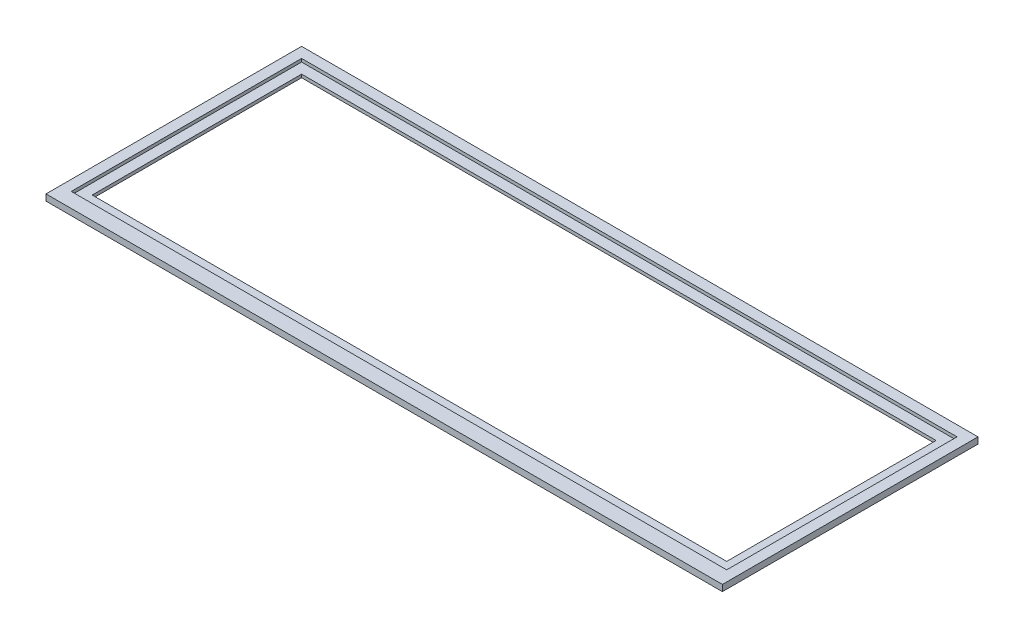
ISO-10303-21;
HEADER;
FILE_DESCRIPTION(('STEP AP214'),'2;1');
FILE_NAME('part.step','',(''),(''),'','','');
FILE_SCHEMA(('AUTOMOTIVE_DESIGN { 1 0 10303 214 1 1 1 1 }'));
ENDSEC;
DATA;
#1=APPLICATION_CONTEXT('core data for automotive mechanical design processes');
#2=APPLICATION_PROTOCOL_DEFINITION('international standard','automotive_design',2000,#1);
#3=PRODUCT_CONTEXT('',#1,'mechanical');
#4=PRODUCT('Part','Part','',(#3));
#5=PRODUCT_RELATED_PRODUCT_CATEGORY('part','',(#4));
#6=PRODUCT_DEFINITION_FORMATION('','',#4);
#7=PRODUCT_DEFINITION_CONTEXT('part definition',#1,'design');
#8=PRODUCT_DEFINITION('design','',#6,#7);
#9=PRODUCT_DEFINITION_SHAPE('','',#8);
#10=(LENGTH_UNIT() NAMED_UNIT(*) SI_UNIT(.MILLI.,.METRE.));
#11=(NAMED_UNIT(*) PLANE_ANGLE_UNIT() SI_UNIT($,.RADIAN.));
#12=(NAMED_UNIT(*) SI_UNIT($,.STERADIAN.) SOLID_ANGLE_UNIT());
#13=UNCERTAINTY_MEASURE_WITH_UNIT(LENGTH_MEASURE(1.E-05),#10,'distance_accuracy_value','');
#14=(GEOMETRIC_REPRESENTATION_CONTEXT(3) GLOBAL_UNCERTAINTY_ASSIGNED_CONTEXT((#13)) GLOBAL_UNIT_ASSIGNED_CONTEXT((#10,
#11,#12)) REPRESENTATION_CONTEXT('',''));
#15=CARTESIAN_POINT('',(0.,0.,0.));
#16=DIRECTION('',(0.,0.,1.));
#17=DIRECTION('',(1.,0.,0.));
#18=AXIS2_PLACEMENT_3D('',#15,#16,#17);
#19=CARTESIAN_POINT('',(161.5,3.,-60.));
#20=DIRECTION('',(-1.,0.,0.));
#21=DIRECTION('',(0.,0.,1.));
#22=AXIS2_PLACEMENT_3D('',#19,#20,#21);
#23=PLANE('',#22);
#24=DIRECTION('',(0.,0.,-1.));
#25=VECTOR('',#24,1.);
#26=CARTESIAN_POINT('',(161.5,0.,-60.));
#27=LINE('',#26,#25);
#28=CARTESIAN_POINT('',(161.5,0.,62.051483501009));
#29=VERTEX_POINT('',#28);
#30=CARTESIAN_POINT('',(161.5,0.,-60.));
#31=VERTEX_POINT('',#30);
#32=EDGE_CURVE('E147',#29,#31,#27,.T.);
#33=ORIENTED_EDGE('',*,*,#32,.T.);
#34=DIRECTION('',(0.,-1.,0.));
#35=VECTOR('',#34,1.);
#36=CARTESIAN_POINT('',(161.5,3.,-60.));
#37=LINE('',#36,#35);
#38=CARTESIAN_POINT('',(161.5,3.,-60.));
#39=VERTEX_POINT('',#38);
#40=EDGE_CURVE('E11',#39,#31,#37,.T.);
#41=ORIENTED_EDGE('',*,*,#40,.F.);
#42=DIRECTION('',(0.,0.,-1.));
#43=VECTOR('',#42,1.);
#44=CARTESIAN_POINT('',(161.5,3.,-60.));
#45=LINE('',#44,#43);
#46=CARTESIAN_POINT('',(161.5,3.,62.051483501009));
#47=VERTEX_POINT('',#46);
#48=EDGE_CURVE('E140',#47,#39,#45,.T.);
#49=ORIENTED_EDGE('',*,*,#48,.F.);
#50=DIRECTION('',(0.,1.,0.));
#51=VECTOR('',#50,1.);
#52=CARTESIAN_POINT('',(161.5,0.,62.051483501009));
#53=LINE('',#52,#51);
#54=EDGE_CURVE('E155',#29,#47,#53,.T.);
#55=ORIENTED_EDGE('',*,*,#54,.F.);
#56=EDGE_LOOP('',(#33,#41,#49,#55));
#57=FACE_BOUND('',#56,.T.);
#58=ADVANCED_FACE('F41',(#57),#23,.F.);
#59=CARTESIAN_POINT('',(-161.5,3.,-60.));
#60=DIRECTION('',(0.,0.,1.));
#61=DIRECTION('',(1.,0.,0.));
#62=AXIS2_PLACEMENT_3D('',#59,#60,#61);
#63=PLANE('',#62);
#64=DIRECTION('',(-1.,0.,0.));
#65=VECTOR('',#64,1.);
#66=CARTESIAN_POINT('',(-161.5,0.,-60.));
#67=LINE('',#66,#65);
#68=CARTESIAN_POINT('',(-161.5,0.,-60.));
#69=VERTEX_POINT('',#68);
#70=EDGE_CURVE('E141',#31,#69,#67,.T.);
#71=ORIENTED_EDGE('',*,*,#70,.T.);
#72=DIRECTION('',(0.,-1.,0.));
#73=VECTOR('',#72,1.);
#74=CARTESIAN_POINT('',(-161.5,3.,-60.));
#75=LINE('',#74,#73);
#76=CARTESIAN_POINT('',(-161.5,3.,-60.));
#77=VERTEX_POINT('',#76);
#78=EDGE_CURVE('E48',#77,#69,#75,.T.);
#79=ORIENTED_EDGE('',*,*,#78,.F.);
#80=DIRECTION('',(-1.,0.,0.));
#81=VECTOR('',#80,1.);
#82=CARTESIAN_POINT('',(-161.5,3.,-60.));
#83=LINE('',#82,#81);
#84=EDGE_CURVE('E221',#39,#77,#83,.T.);
#85=ORIENTED_EDGE('',*,*,#84,.F.);
#86=ORIENTED_EDGE('',*,*,#40,.T.);
#87=EDGE_LOOP('',(#71,#79,#85,#86));
#88=FACE_BOUND('',#87,.T.);
#89=ADVANCED_FACE('F227',(#88),#63,.F.);
#90=CARTESIAN_POINT('',(-161.5,3.,-60.));
#91=DIRECTION('',(1.,0.,0.));
#92=DIRECTION('',(0.,0.,-1.));
#93=AXIS2_PLACEMENT_3D('',#90,#91,#92);
#94=PLANE('',#93);
#95=DIRECTION('',(0.,0.,1.));
#96=VECTOR('',#95,1.);
#97=CARTESIAN_POINT('',(-161.5,0.,-60.));
#98=LINE('',#97,#96);
#99=CARTESIAN_POINT('',(-161.5,0.,62.051483501009));
#100=VERTEX_POINT('',#99);
#101=EDGE_CURVE('E131',#69,#100,#98,.T.);
#102=ORIENTED_EDGE('',*,*,#101,.T.);
#103=DIRECTION('',(0.,1.,0.));
#104=VECTOR('',#103,1.);
#105=CARTESIAN_POINT('',(-161.5,0.,62.051483501009));
#106=LINE('',#105,#104);
#107=CARTESIAN_POINT('',(-161.5,3.,62.051483501009));
#108=VERTEX_POINT('',#107);
#109=EDGE_CURVE('E136',#100,#108,#106,.T.);
#110=ORIENTED_EDGE('',*,*,#109,.T.);
#111=DIRECTION('',(0.,0.,1.));
#112=VECTOR('',#111,1.);
#113=CARTESIAN_POINT('',(-161.5,3.,-60.));
#114=LINE('',#113,#112);
#115=EDGE_CURVE('E223',#77,#108,#114,.T.);
#116=ORIENTED_EDGE('',*,*,#115,.F.);
#117=ORIENTED_EDGE('',*,*,#78,.T.);
#118=EDGE_LOOP('',(#102,#110,#116,#117));
#119=FACE_BOUND('',#118,.T.);
#120=ADVANCED_FACE('F133',(#119),#94,.F.);
#121=CARTESIAN_POINT('',(0.,3.,0.));
#122=DIRECTION('',(0.,1.,0.));
#123=DIRECTION('',(0.,0.,1.));
#124=AXIS2_PLACEMENT_3D('',#121,#122,#123);
#125=PLANE('',#124);
#126=DIRECTION('',(0.,0.,1.));
#127=VECTOR('',#126,1.);
#128=CARTESIAN_POINT('',(-156.5,3.,0.));
#129=LINE('',#128,#127);
#130=CARTESIAN_POINT('',(-156.5,3.,-55.));
#131=VERTEX_POINT('',#130);
#132=CARTESIAN_POINT('',(-156.5,3.,55.));
#133=VERTEX_POINT('',#132);
#134=EDGE_CURVE('E63',#131,#133,#129,.T.);
#135=ORIENTED_EDGE('',*,*,#134,.F.);
#136=DIRECTION('',(-1.,0.,0.));
#137=VECTOR('',#136,1.);
#138=CARTESIAN_POINT('',(0.,3.,-55.));
#139=LINE('',#138,#137);
#140=CARTESIAN_POINT('',(156.5,3.,-55.));
#141=VERTEX_POINT('',#140);
#142=EDGE_CURVE('E183',#141,#131,#139,.T.);
#143=ORIENTED_EDGE('',*,*,#142,.F.);
#144=DIRECTION('',(0.,0.,-1.));
#145=VECTOR('',#144,1.);
#146=CARTESIAN_POINT('',(156.5,3.,0.));
#147=LINE('',#146,#145);
#148=CARTESIAN_POINT('',(156.5,3.,55.));
#149=VERTEX_POINT('',#148);
#150=EDGE_CURVE('E207',#149,#141,#147,.T.);
#151=ORIENTED_EDGE('',*,*,#150,.F.);
#152=DIRECTION('',(1.,0.,0.));
#153=VECTOR('',#152,1.);
#154=CARTESIAN_POINT('',(0.,3.,55.));
#155=LINE('',#154,#153);
#156=EDGE_CURVE('E204',#133,#149,#155,.T.);
#157=ORIENTED_EDGE('',*,*,#156,.F.);
#158=EDGE_LOOP('',(#135,#143,#151,#157));
#159=FACE_BOUND('',#158,.T.);
#160=ORIENTED_EDGE('',*,*,#48,.T.);
#161=ORIENTED_EDGE('',*,*,#84,.T.);
#162=ORIENTED_EDGE('',*,*,#115,.T.);
#163=DIRECTION('',(-1.,0.,0.));
#164=VECTOR('',#163,1.);
#165=CARTESIAN_POINT('',(0.,3.,62.051483501009));
#166=LINE('',#165,#164);
#167=EDGE_CURVE('E151',#47,#108,#166,.T.);
#168=ORIENTED_EDGE('',*,*,#167,.F.);
#169=EDGE_LOOP('',(#160,#161,#162,#168));
#170=FACE_BOUND('',#169,.T.);
#171=ADVANCED_FACE('F231',(#159,#170),#125,.T.);
#172=CARTESIAN_POINT('',(0.,0.,0.));
#173=DIRECTION('',(0.,1.,0.));
#174=DIRECTION('',(0.,0.,1.));
#175=AXIS2_PLACEMENT_3D('',#172,#173,#174);
#176=PLANE('',#175);
#177=DIRECTION('',(0.,0.,1.));
#178=VECTOR('',#177,1.);
#179=CARTESIAN_POINT('',(-151.5,0.,0.));
#180=LINE('',#179,#178);
#181=CARTESIAN_POINT('',(-151.5,0.,-50.));
#182=VERTEX_POINT('',#181);
#183=CARTESIAN_POINT('',(-151.5,0.,50.));
#184=VERTEX_POINT('',#183);
#185=EDGE_CURVE('E167',#182,#184,#180,.T.);
#186=ORIENTED_EDGE('',*,*,#185,.T.);
#187=DIRECTION('',(1.,0.,0.));
#188=VECTOR('',#187,1.);
#189=CARTESIAN_POINT('',(0.,0.,50.));
#190=LINE('',#189,#188);
#191=CARTESIAN_POINT('',(151.5,0.,50.));
#192=VERTEX_POINT('',#191);
#193=EDGE_CURVE('E157',#184,#192,#190,.T.);
#194=ORIENTED_EDGE('',*,*,#193,.T.);
#195=DIRECTION('',(0.,0.,-1.));
#196=VECTOR('',#195,1.);
#197=CARTESIAN_POINT('',(151.5,0.,0.));
#198=LINE('',#197,#196);
#199=CARTESIAN_POINT('',(151.5,0.,-50.));
#200=VERTEX_POINT('',#199);
#201=EDGE_CURVE('E163',#192,#200,#198,.T.);
#202=ORIENTED_EDGE('',*,*,#201,.T.);
#203=DIRECTION('',(-1.,0.,0.));
#204=VECTOR('',#203,1.);
#205=CARTESIAN_POINT('',(0.,0.,-50.));
#206=LINE('',#205,#204);
#207=EDGE_CURVE('E55',#200,#182,#206,.T.);
#208=ORIENTED_EDGE('',*,*,#207,.T.);
#209=EDGE_LOOP('',(#186,#194,#202,#208));
#210=FACE_BOUND('',#209,.T.);
#211=ORIENTED_EDGE('',*,*,#32,.F.);
#212=DIRECTION('',(-1.,0.,0.));
#213=VECTOR('',#212,1.);
#214=CARTESIAN_POINT('',(0.,0.,62.051483501009));
#215=LINE('',#214,#213);
#216=EDGE_CURVE('E144',#29,#100,#215,.T.);
#217=ORIENTED_EDGE('',*,*,#216,.T.);
#218=ORIENTED_EDGE('',*,*,#101,.F.);
#219=ORIENTED_EDGE('',*,*,#70,.F.);
#220=EDGE_LOOP('',(#211,#217,#218,#219));
#221=FACE_BOUND('',#220,.T.);
#222=ADVANCED_FACE('F145',(#210,#221),#176,.F.);
#223=CARTESIAN_POINT('',(-156.5,1.5,0.));
#224=DIRECTION('',(-1.,0.,0.));
#225=DIRECTION('',(0.,0.,1.));
#226=AXIS2_PLACEMENT_3D('',#223,#224,#225);
#227=PLANE('',#226);
#228=ORIENTED_EDGE('',*,*,#134,.T.);
#229=DIRECTION('',(0.,1.,0.));
#230=VECTOR('',#229,1.);
#231=CARTESIAN_POINT('',(-156.5,1.5,55.));
#232=LINE('',#231,#230);
#233=CARTESIAN_POINT('',(-156.5,1.5,55.));
#234=VERTEX_POINT('',#233);
#235=EDGE_CURVE('E202',#234,#133,#232,.T.);
#236=ORIENTED_EDGE('',*,*,#235,.F.);
#237=DIRECTION('',(0.,0.,1.));
#238=VECTOR('',#237,1.);
#239=CARTESIAN_POINT('',(-156.5,1.5,0.));
#240=LINE('',#239,#238);
#241=CARTESIAN_POINT('',(-156.5,1.5,-55.));
#242=VERTEX_POINT('',#241);
#243=EDGE_CURVE('E190',#242,#234,#240,.T.);
#244=ORIENTED_EDGE('',*,*,#243,.F.);
#245=DIRECTION('',(0.,1.,0.));
#246=VECTOR('',#245,1.);
#247=CARTESIAN_POINT('',(-156.5,1.5,-55.));
#248=LINE('',#247,#246);
#249=EDGE_CURVE('E212',#242,#131,#248,.T.);
#250=ORIENTED_EDGE('',*,*,#249,.T.);
#251=EDGE_LOOP('',(#228,#236,#244,#250));
#252=FACE_BOUND('',#251,.T.);
#253=ADVANCED_FACE('F239',(#252),#227,.F.);
#254=CARTESIAN_POINT('',(0.,1.5,-55.));
#255=DIRECTION('',(0.,0.,-1.));
#256=DIRECTION('',(-1.,0.,0.));
#257=AXIS2_PLACEMENT_3D('',#254,#255,#256);
#258=PLANE('',#257);
#259=ORIENTED_EDGE('',*,*,#142,.T.);
#260=ORIENTED_EDGE('',*,*,#249,.F.);
#261=DIRECTION('',(-1.,0.,0.));
#262=VECTOR('',#261,1.);
#263=CARTESIAN_POINT('',(0.,1.5,-55.));
#264=LINE('',#263,#262);
#265=CARTESIAN_POINT('',(156.5,1.5,-55.));
#266=VERTEX_POINT('',#265);
#267=EDGE_CURVE('E199',#266,#242,#264,.T.);
#268=ORIENTED_EDGE('',*,*,#267,.F.);
#269=DIRECTION('',(0.,1.,0.));
#270=VECTOR('',#269,1.);
#271=CARTESIAN_POINT('',(156.5,1.5,-55.));
#272=LINE('',#271,#270);
#273=EDGE_CURVE('E214',#266,#141,#272,.T.);
#274=ORIENTED_EDGE('',*,*,#273,.T.);
#275=EDGE_LOOP('',(#259,#260,#268,#274));
#276=FACE_BOUND('',#275,.T.);
#277=ADVANCED_FACE('F257',(#276),#258,.F.);
#278=CARTESIAN_POINT('',(156.5,1.5,0.));
#279=DIRECTION('',(1.,0.,0.));
#280=DIRECTION('',(0.,0.,-1.));
#281=AXIS2_PLACEMENT_3D('',#278,#279,#280);
#282=PLANE('',#281);
#283=ORIENTED_EDGE('',*,*,#150,.T.);
#284=ORIENTED_EDGE('',*,*,#273,.F.);
#285=DIRECTION('',(0.,0.,-1.));
#286=VECTOR('',#285,1.);
#287=CARTESIAN_POINT('',(156.5,1.5,0.));
#288=LINE('',#287,#286);
#289=CARTESIAN_POINT('',(156.5,1.5,55.));
#290=VERTEX_POINT('',#289);
#291=EDGE_CURVE('E196',#290,#266,#288,.T.);
#292=ORIENTED_EDGE('',*,*,#291,.F.);
#293=DIRECTION('',(0.,1.,0.));
#294=VECTOR('',#293,1.);
#295=CARTESIAN_POINT('',(156.5,1.5,55.));
#296=LINE('',#295,#294);
#297=EDGE_CURVE('E216',#290,#149,#296,.T.);
#298=ORIENTED_EDGE('',*,*,#297,.T.);
#299=EDGE_LOOP('',(#283,#284,#292,#298));
#300=FACE_BOUND('',#299,.T.);
#301=ADVANCED_FACE('F263',(#300),#282,.F.);
#302=CARTESIAN_POINT('',(0.,1.5,55.));
#303=DIRECTION('',(0.,0.,1.));
#304=DIRECTION('',(1.,0.,0.));
#305=AXIS2_PLACEMENT_3D('',#302,#303,#304);
#306=PLANE('',#305);
#307=ORIENTED_EDGE('',*,*,#156,.T.);
#308=ORIENTED_EDGE('',*,*,#297,.F.);
#309=DIRECTION('',(1.,0.,0.));
#310=VECTOR('',#309,1.);
#311=CARTESIAN_POINT('',(0.,1.5,55.));
#312=LINE('',#311,#310);
#313=EDGE_CURVE('E193',#234,#290,#312,.T.);
#314=ORIENTED_EDGE('',*,*,#313,.F.);
#315=ORIENTED_EDGE('',*,*,#235,.T.);
#316=EDGE_LOOP('',(#307,#308,#314,#315));
#317=FACE_BOUND('',#316,.T.);
#318=ADVANCED_FACE('F271',(#317),#306,.F.);
#319=CARTESIAN_POINT('',(0.,1.5,0.));
#320=DIRECTION('',(0.,1.,0.));
#321=DIRECTION('',(0.,0.,1.));
#322=AXIS2_PLACEMENT_3D('',#319,#320,#321);
#323=PLANE('',#322);
#324=DIRECTION('',(0.,0.,-1.));
#325=VECTOR('',#324,1.);
#326=CARTESIAN_POINT('',(151.5,1.5,0.));
#327=LINE('',#326,#325);
#328=CARTESIAN_POINT('',(151.5,1.5,50.));
#329=VERTEX_POINT('',#328);
#330=CARTESIAN_POINT('',(151.5,1.5,-50.));
#331=VERTEX_POINT('',#330);
#332=EDGE_CURVE('E180',#329,#331,#327,.T.);
#333=ORIENTED_EDGE('',*,*,#332,.F.);
#334=DIRECTION('',(1.,0.,0.));
#335=VECTOR('',#334,1.);
#336=CARTESIAN_POINT('',(0.,1.5,50.));
#337=LINE('',#336,#335);
#338=CARTESIAN_POINT('',(-151.5,1.5,50.));
#339=VERTEX_POINT('',#338);
#340=EDGE_CURVE('E182',#339,#329,#337,.T.);
#341=ORIENTED_EDGE('',*,*,#340,.F.);
#342=DIRECTION('',(0.,0.,1.));
#343=VECTOR('',#342,1.);
#344=CARTESIAN_POINT('',(-151.5,1.5,0.));
#345=LINE('',#344,#343);
#346=CARTESIAN_POINT('',(-151.5,1.5,-50.));
#347=VERTEX_POINT('',#346);
#348=EDGE_CURVE('E186',#347,#339,#345,.T.);
#349=ORIENTED_EDGE('',*,*,#348,.F.);
#350=DIRECTION('',(-1.,0.,0.));
#351=VECTOR('',#350,1.);
#352=CARTESIAN_POINT('',(0.,1.5,-50.));
#353=LINE('',#352,#351);
#354=EDGE_CURVE('E188',#331,#347,#353,.T.);
#355=ORIENTED_EDGE('',*,*,#354,.F.);
#356=EDGE_LOOP('',(#333,#341,#349,#355));
#357=FACE_BOUND('',#356,.T.);
#358=ORIENTED_EDGE('',*,*,#243,.T.);
#359=ORIENTED_EDGE('',*,*,#313,.T.);
#360=ORIENTED_EDGE('',*,*,#291,.T.);
#361=ORIENTED_EDGE('',*,*,#267,.T.);
#362=EDGE_LOOP('',(#358,#359,#360,#361));
#363=FACE_BOUND('',#362,.T.);
#364=ADVANCED_FACE('F279',(#357,#363),#323,.T.);
#365=CARTESIAN_POINT('',(0.,0.,50.));
#366=DIRECTION('',(0.,0.,1.));
#367=DIRECTION('',(1.,0.,0.));
#368=AXIS2_PLACEMENT_3D('',#365,#366,#367);
#369=PLANE('',#368);
#370=ORIENTED_EDGE('',*,*,#340,.T.);
#371=DIRECTION('',(0.,1.,0.));
#372=VECTOR('',#371,1.);
#373=CARTESIAN_POINT('',(151.5,0.,50.));
#374=LINE('',#373,#372);
#375=EDGE_CURVE('E170',#192,#329,#374,.T.);
#376=ORIENTED_EDGE('',*,*,#375,.F.);
#377=ORIENTED_EDGE('',*,*,#193,.F.);
#378=DIRECTION('',(0.,1.,0.));
#379=VECTOR('',#378,1.);
#380=CARTESIAN_POINT('',(-151.5,0.,50.));
#381=LINE('',#380,#379);
#382=EDGE_CURVE('E171',#184,#339,#381,.T.);
#383=ORIENTED_EDGE('',*,*,#382,.T.);
#384=EDGE_LOOP('',(#370,#376,#377,#383));
#385=FACE_BOUND('',#384,.T.);
#386=ADVANCED_FACE('F288',(#385),#369,.F.);
#387=CARTESIAN_POINT('',(-151.5,0.,0.));
#388=DIRECTION('',(-1.,0.,0.));
#389=DIRECTION('',(0.,0.,1.));
#390=AXIS2_PLACEMENT_3D('',#387,#388,#389);
#391=PLANE('',#390);
#392=ORIENTED_EDGE('',*,*,#348,.T.);
#393=ORIENTED_EDGE('',*,*,#382,.F.);
#394=ORIENTED_EDGE('',*,*,#185,.F.);
#395=DIRECTION('',(0.,1.,0.));
#396=VECTOR('',#395,1.);
#397=CARTESIAN_POINT('',(-151.5,0.,-50.));
#398=LINE('',#397,#396);
#399=EDGE_CURVE('E174',#182,#347,#398,.T.);
#400=ORIENTED_EDGE('',*,*,#399,.T.);
#401=EDGE_LOOP('',(#392,#393,#394,#400));
#402=FACE_BOUND('',#401,.T.);
#403=ADVANCED_FACE('F295',(#402),#391,.F.);
#404=CARTESIAN_POINT('',(0.,0.,-50.));
#405=DIRECTION('',(0.,0.,-1.));
#406=DIRECTION('',(-1.,0.,0.));
#407=AXIS2_PLACEMENT_3D('',#404,#405,#406);
#408=PLANE('',#407);
#409=ORIENTED_EDGE('',*,*,#354,.T.);
#410=ORIENTED_EDGE('',*,*,#399,.F.);
#411=ORIENTED_EDGE('',*,*,#207,.F.);
#412=DIRECTION('',(0.,1.,0.));
#413=VECTOR('',#412,1.);
#414=CARTESIAN_POINT('',(151.5,0.,-50.));
#415=LINE('',#414,#413);
#416=EDGE_CURVE('E177',#200,#331,#415,.T.);
#417=ORIENTED_EDGE('',*,*,#416,.T.);
#418=EDGE_LOOP('',(#409,#410,#411,#417));
#419=FACE_BOUND('',#418,.T.);
#420=ADVANCED_FACE('F303',(#419),#408,.F.);
#421=CARTESIAN_POINT('',(151.5,0.,0.));
#422=DIRECTION('',(1.,0.,0.));
#423=DIRECTION('',(0.,0.,-1.));
#424=AXIS2_PLACEMENT_3D('',#421,#422,#423);
#425=PLANE('',#424);
#426=ORIENTED_EDGE('',*,*,#332,.T.);
#427=ORIENTED_EDGE('',*,*,#416,.F.);
#428=ORIENTED_EDGE('',*,*,#201,.F.);
#429=ORIENTED_EDGE('',*,*,#375,.T.);
#430=EDGE_LOOP('',(#426,#427,#428,#429));
#431=FACE_BOUND('',#430,.T.);
#432=ADVANCED_FACE('F310',(#431),#425,.F.);
#433=CARTESIAN_POINT('',(0.,0.,62.051483501009));
#434=DIRECTION('',(0.,0.,-1.));
#435=DIRECTION('',(-1.,0.,0.));
#436=AXIS2_PLACEMENT_3D('',#433,#434,#435);
#437=PLANE('',#436);
#438=ORIENTED_EDGE('',*,*,#167,.T.);
#439=ORIENTED_EDGE('',*,*,#109,.F.);
#440=ORIENTED_EDGE('',*,*,#216,.F.);
#441=ORIENTED_EDGE('',*,*,#54,.T.);
#442=EDGE_LOOP('',(#438,#439,#440,#441));
#443=FACE_BOUND('',#442,.T.);
#444=ADVANCED_FACE('F153',(#443),#437,.F.);
#445=CLOSED_SHELL('',(#58,#89,#120,#171,#222,#253,#277,#301,#318,#364,#386,#403,#420,#432,#444));
#446=MANIFOLD_SOLID_BREP('B2',#445);
#447=ADVANCED_BREP_SHAPE_REPRESENTATION('',(#18,#446),#14);
#448=SHAPE_DEFINITION_REPRESENTATION(#9,#447);
ENDSEC;
END-ISO-10303-21;
